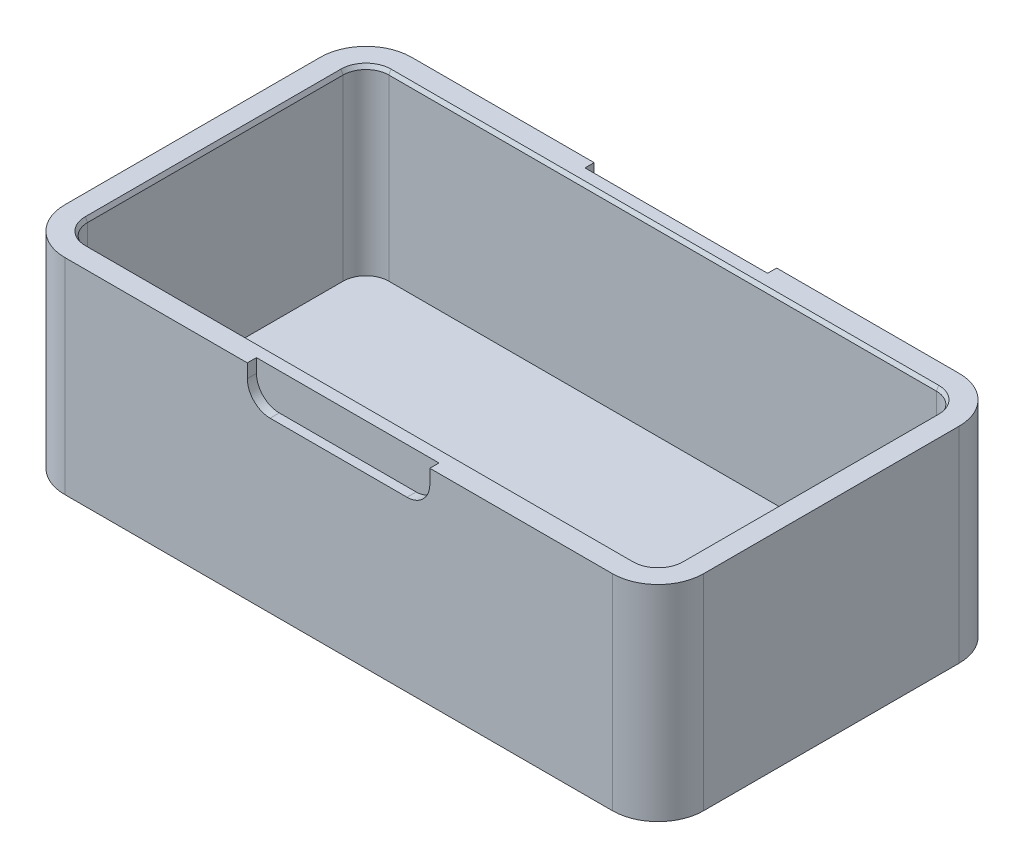
ISO-10303-21;
HEADER;
FILE_DESCRIPTION(('STEP AP214'),'2;1');
FILE_NAME('part.step','',(''),(''),'','','');
FILE_SCHEMA(('AUTOMOTIVE_DESIGN { 1 0 10303 214 1 1 1 1 }'));
ENDSEC;
DATA;
#1=APPLICATION_CONTEXT('core data for automotive mechanical design processes');
#2=APPLICATION_PROTOCOL_DEFINITION('international standard','automotive_design',2000,#1);
#3=PRODUCT_CONTEXT('',#1,'mechanical');
#4=PRODUCT('Part','Part','',(#3));
#5=PRODUCT_RELATED_PRODUCT_CATEGORY('part','',(#4));
#6=PRODUCT_DEFINITION_FORMATION('','',#4);
#7=PRODUCT_DEFINITION_CONTEXT('part definition',#1,'design');
#8=PRODUCT_DEFINITION('design','',#6,#7);
#9=PRODUCT_DEFINITION_SHAPE('','',#8);
#10=(LENGTH_UNIT() NAMED_UNIT(*) SI_UNIT(.MILLI.,.METRE.));
#11=(NAMED_UNIT(*) PLANE_ANGLE_UNIT() SI_UNIT($,.RADIAN.));
#12=(NAMED_UNIT(*) SI_UNIT($,.STERADIAN.) SOLID_ANGLE_UNIT());
#13=UNCERTAINTY_MEASURE_WITH_UNIT(LENGTH_MEASURE(1.E-05),#10,'distance_accuracy_value','');
#14=(GEOMETRIC_REPRESENTATION_CONTEXT(3) GLOBAL_UNCERTAINTY_ASSIGNED_CONTEXT((#13)) GLOBAL_UNIT_ASSIGNED_CONTEXT((#10,
#11,#12)) REPRESENTATION_CONTEXT('',''));
#15=CARTESIAN_POINT('',(0.,0.,0.));
#16=DIRECTION('',(0.,0.,1.));
#17=DIRECTION('',(1.,0.,0.));
#18=AXIS2_PLACEMENT_3D('',#15,#16,#17);
#19=CARTESIAN_POINT('',(0.,45.,-76.));
#20=DIRECTION('',(0.,0.,1.));
#21=DIRECTION('',(1.,0.,0.));
#22=AXIS2_PLACEMENT_3D('',#19,#20,#21);
#23=PLANE('',#22);
#24=DIRECTION('',(0.,-1.,0.));
#25=VECTOR('',#24,1.);
#26=CARTESIAN_POINT('',(50.,45.,-76.));
#27=LINE('',#26,#25);
#28=CARTESIAN_POINT('',(50.,45.,-76.));
#29=VERTEX_POINT('',#28);
#30=CARTESIAN_POINT('',(50.,42.,-76.));
#31=VERTEX_POINT('',#30);
#32=EDGE_CURVE('E493',#29,#31,#27,.T.);
#33=ORIENTED_EDGE('',*,*,#32,.T.);
#34=CARTESIAN_POINT('',(55.,42.,-76.));
#35=DIRECTION('',(0.,0.,1.));
#36=DIRECTION('',(1.,0.,0.));
#37=AXIS2_PLACEMENT_3D('',#34,#35,#36);
#38=CIRCLE('',#37,5.);
#39=CARTESIAN_POINT('',(55.,37.,-76.));
#40=VERTEX_POINT('',#39);
#41=EDGE_CURVE('E440',#31,#40,#38,.T.);
#42=ORIENTED_EDGE('',*,*,#41,.T.);
#43=DIRECTION('',(1.,0.,0.));
#44=VECTOR('',#43,1.);
#45=CARTESIAN_POINT('',(50.,37.,-76.));
#46=LINE('',#45,#44);
#47=CARTESIAN_POINT('',(85.,37.,-76.));
#48=VERTEX_POINT('',#47);
#49=EDGE_CURVE('E277',#40,#48,#46,.T.);
#50=ORIENTED_EDGE('',*,*,#49,.T.);
#51=CARTESIAN_POINT('',(85.,42.,-76.));
#52=DIRECTION('',(0.,0.,1.));
#53=DIRECTION('',(1.,0.,0.));
#54=AXIS2_PLACEMENT_3D('',#51,#52,#53);
#55=CIRCLE('',#54,5.);
#56=CARTESIAN_POINT('',(90.,42.,-76.));
#57=VERTEX_POINT('',#56);
#58=EDGE_CURVE('E438',#48,#57,#55,.T.);
#59=ORIENTED_EDGE('',*,*,#58,.T.);
#60=DIRECTION('',(0.,1.,0.));
#61=VECTOR('',#60,1.);
#62=CARTESIAN_POINT('',(90.,45.,-76.));
#63=LINE('',#62,#61);
#64=CARTESIAN_POINT('',(90.,45.,-76.));
#65=VERTEX_POINT('',#64);
#66=EDGE_CURVE('E499',#57,#65,#63,.T.);
#67=ORIENTED_EDGE('',*,*,#66,.T.);
#68=DIRECTION('',(-1.,0.,0.));
#69=VECTOR('',#68,1.);
#70=CARTESIAN_POINT('',(0.,45.,-76.));
#71=LINE('',#70,#69);
#72=CARTESIAN_POINT('',(130.,45.,-76.));
#73=VERTEX_POINT('',#72);
#74=EDGE_CURVE('E268',#73,#65,#71,.T.);
#75=ORIENTED_EDGE('',*,*,#74,.F.);
#76=DIRECTION('',(0.,-1.,0.));
#77=VECTOR('',#76,1.);
#78=CARTESIAN_POINT('',(130.,45.,-76.));
#79=LINE('',#78,#77);
#80=CARTESIAN_POINT('',(130.,0.,-76.));
#81=VERTEX_POINT('',#80);
#82=EDGE_CURVE('E372',#73,#81,#79,.T.);
#83=ORIENTED_EDGE('',*,*,#82,.T.);
#84=DIRECTION('',(-1.,0.,0.));
#85=VECTOR('',#84,1.);
#86=CARTESIAN_POINT('',(0.,0.,-76.));
#87=LINE('',#86,#85);
#88=CARTESIAN_POINT('',(9.99999999999997,0.,-76.));
#89=VERTEX_POINT('',#88);
#90=EDGE_CURVE('E350',#81,#89,#87,.T.);
#91=ORIENTED_EDGE('',*,*,#90,.T.);
#92=DIRECTION('',(0.,-1.,0.));
#93=VECTOR('',#92,1.);
#94=CARTESIAN_POINT('',(9.99999999999997,45.,-76.));
#95=LINE('',#94,#93);
#96=CARTESIAN_POINT('',(9.99999999999997,45.,-76.));
#97=VERTEX_POINT('',#96);
#98=EDGE_CURVE('E359',#89,#97,#95,.F.);
#99=ORIENTED_EDGE('',*,*,#98,.T.);
#100=EDGE_CURVE('E357',#29,#97,#71,.T.);
#101=ORIENTED_EDGE('',*,*,#100,.F.);
#102=EDGE_LOOP('',(#33,#42,#50,#59,#67,#75,#83,#91,#99,#101));
#103=FACE_BOUND('',#102,.T.);
#104=ADVANCED_FACE('F34',(#103),#23,.F.);
#105=CARTESIAN_POINT('',(0.,45.,0.));
#106=DIRECTION('',(0.,-1.,0.));
#107=DIRECTION('',(0.,0.,-1.));
#108=AXIS2_PLACEMENT_3D('',#105,#106,#107);
#109=PLANE('',#108);
#110=CARTESIAN_POINT('',(130.,45.,-10.));
#111=DIRECTION('',(0.,-1.,0.));
#112=DIRECTION('',(0.,0.,-1.));
#113=AXIS2_PLACEMENT_3D('',#110,#111,#112);
#114=CIRCLE('',#113,5.49999999999999);
#115=CARTESIAN_POINT('',(135.5,45.,-10.));
#116=VERTEX_POINT('',#115);
#117=CARTESIAN_POINT('',(130.,45.,-4.50000000000001));
#118=VERTEX_POINT('',#117);
#119=EDGE_CURVE('E457',#116,#118,#114,.T.);
#120=ORIENTED_EDGE('',*,*,#119,.T.);
#121=DIRECTION('',(-1.,0.,0.));
#122=VECTOR('',#121,1.);
#123=CARTESIAN_POINT('',(0.,45.,-4.50000000000001));
#124=LINE('',#123,#122);
#125=CARTESIAN_POINT('',(9.99999999999999,45.,-4.50000000000001));
#126=VERTEX_POINT('',#125);
#127=EDGE_CURVE('E459',#118,#126,#124,.T.);
#128=ORIENTED_EDGE('',*,*,#127,.T.);
#129=CARTESIAN_POINT('',(9.99999999999999,45.,-10.));
#130=DIRECTION('',(0.,-1.,0.));
#131=DIRECTION('',(0.,0.,-1.));
#132=AXIS2_PLACEMENT_3D('',#129,#130,#131);
#133=CIRCLE('',#132,5.49999999999998);
#134=CARTESIAN_POINT('',(4.50000000000001,45.,-9.99999999999999));
#135=VERTEX_POINT('',#134);
#136=EDGE_CURVE('E455',#126,#135,#133,.T.);
#137=ORIENTED_EDGE('',*,*,#136,.T.);
#138=DIRECTION('',(0.,0.,-1.));
#139=VECTOR('',#138,1.);
#140=CARTESIAN_POINT('',(4.50000000000001,45.,0.));
#141=LINE('',#140,#139);
#142=CARTESIAN_POINT('',(4.49999999999998,45.,-66.));
#143=VERTEX_POINT('',#142);
#144=EDGE_CURVE('E451',#135,#143,#141,.T.);
#145=ORIENTED_EDGE('',*,*,#144,.T.);
#146=CARTESIAN_POINT('',(9.99999999999997,45.,-66.));
#147=DIRECTION('',(0.,-1.,0.));
#148=DIRECTION('',(0.,0.,-1.));
#149=AXIS2_PLACEMENT_3D('',#146,#147,#148);
#150=CIRCLE('',#149,5.49999999999999);
#151=CARTESIAN_POINT('',(9.99999999999998,45.,-71.5));
#152=VERTEX_POINT('',#151);
#153=EDGE_CURVE('E447',#143,#152,#150,.T.);
#154=ORIENTED_EDGE('',*,*,#153,.T.);
#155=DIRECTION('',(1.,0.,0.));
#156=VECTOR('',#155,1.);
#157=CARTESIAN_POINT('',(0.,45.,-71.5));
#158=LINE('',#157,#156);
#159=CARTESIAN_POINT('',(130.,45.,-71.5));
#160=VERTEX_POINT('',#159);
#161=EDGE_CURVE('E445',#152,#160,#158,.T.);
#162=ORIENTED_EDGE('',*,*,#161,.T.);
#163=CARTESIAN_POINT('',(130.,45.,-66.));
#164=DIRECTION('',(0.,-1.,0.));
#165=DIRECTION('',(0.,0.,-1.));
#166=AXIS2_PLACEMENT_3D('',#163,#164,#165);
#167=CIRCLE('',#166,5.50000000000001);
#168=CARTESIAN_POINT('',(135.5,45.,-66.));
#169=VERTEX_POINT('',#168);
#170=EDGE_CURVE('E449',#160,#169,#167,.T.);
#171=ORIENTED_EDGE('',*,*,#170,.T.);
#172=DIRECTION('',(0.,0.,1.));
#173=VECTOR('',#172,1.);
#174=CARTESIAN_POINT('',(135.5,45.,0.));
#175=LINE('',#174,#173);
#176=EDGE_CURVE('E453',#169,#116,#175,.T.);
#177=ORIENTED_EDGE('',*,*,#176,.T.);
#178=EDGE_LOOP('',(#120,#128,#137,#145,#154,#162,#171,#177));
#179=FACE_BOUND('',#178,.T.);
#180=DIRECTION('',(0.,0.,-1.));
#181=VECTOR('',#180,1.);
#182=CARTESIAN_POINT('',(50.,45.,-74.));
#183=LINE('',#182,#181);
#184=CARTESIAN_POINT('',(50.,45.,-74.));
#185=VERTEX_POINT('',#184);
#186=EDGE_CURVE('E270',#185,#29,#183,.T.);
#187=ORIENTED_EDGE('',*,*,#186,.T.);
#188=ORIENTED_EDGE('',*,*,#100,.T.);
#189=CARTESIAN_POINT('',(9.99999999999997,45.,-66.));
#190=DIRECTION('',(0.,-1.,0.));
#191=DIRECTION('',(0.,0.,-1.));
#192=AXIS2_PLACEMENT_3D('',#189,#190,#191);
#193=CIRCLE('',#192,10.);
#194=CARTESIAN_POINT('',(0.,45.,-66.));
#195=VERTEX_POINT('',#194);
#196=EDGE_CURVE('E390',#97,#195,#193,.F.);
#197=ORIENTED_EDGE('',*,*,#196,.T.);
#198=DIRECTION('',(0.,0.,1.));
#199=VECTOR('',#198,1.);
#200=CARTESIAN_POINT('',(0.,45.,0.));
#201=LINE('',#200,#199);
#202=CARTESIAN_POINT('',(0.,45.,-9.99999999999999));
#203=VERTEX_POINT('',#202);
#204=EDGE_CURVE('E346',#195,#203,#201,.T.);
#205=ORIENTED_EDGE('',*,*,#204,.T.);
#206=CARTESIAN_POINT('',(9.99999999999999,45.,-10.));
#207=DIRECTION('',(0.,-1.,0.));
#208=DIRECTION('',(0.,0.,-1.));
#209=AXIS2_PLACEMENT_3D('',#206,#207,#208);
#210=CIRCLE('',#209,10.);
#211=CARTESIAN_POINT('',(9.99999999999999,45.,0.));
#212=VERTEX_POINT('',#211);
#213=EDGE_CURVE('E388',#203,#212,#210,.F.);
#214=ORIENTED_EDGE('',*,*,#213,.T.);
#215=DIRECTION('',(1.,0.,0.));
#216=VECTOR('',#215,1.);
#217=CARTESIAN_POINT('',(0.,45.,0.));
#218=LINE('',#217,#216);
#219=CARTESIAN_POINT('',(50.,45.,0.));
#220=VERTEX_POINT('',#219);
#221=EDGE_CURVE('E351',#212,#220,#218,.T.);
#222=ORIENTED_EDGE('',*,*,#221,.T.);
#223=DIRECTION('',(0.,0.,1.));
#224=VECTOR('',#223,1.);
#225=CARTESIAN_POINT('',(50.,45.,-2.));
#226=LINE('',#225,#224);
#227=CARTESIAN_POINT('',(50.,45.,-2.));
#228=VERTEX_POINT('',#227);
#229=EDGE_CURVE('E296',#228,#220,#226,.T.);
#230=ORIENTED_EDGE('',*,*,#229,.F.);
#231=DIRECTION('',(-1.,0.,0.));
#232=VECTOR('',#231,1.);
#233=CARTESIAN_POINT('',(50.,45.,-2.));
#234=LINE('',#233,#232);
#235=CARTESIAN_POINT('',(90.,45.,-2.));
#236=VERTEX_POINT('',#235);
#237=EDGE_CURVE('E289',#236,#228,#234,.T.);
#238=ORIENTED_EDGE('',*,*,#237,.F.);
#239=DIRECTION('',(0.,0.,1.));
#240=VECTOR('',#239,1.);
#241=CARTESIAN_POINT('',(90.,45.,-2.));
#242=LINE('',#241,#240);
#243=CARTESIAN_POINT('',(90.,45.,0.));
#244=VERTEX_POINT('',#243);
#245=EDGE_CURVE('E291',#236,#244,#242,.T.);
#246=ORIENTED_EDGE('',*,*,#245,.T.);
#247=CARTESIAN_POINT('',(130.,45.,0.));
#248=VERTEX_POINT('',#247);
#249=EDGE_CURVE('E349',#244,#248,#218,.T.);
#250=ORIENTED_EDGE('',*,*,#249,.T.);
#251=CARTESIAN_POINT('',(130.,45.,-10.));
#252=DIRECTION('',(0.,-1.,0.));
#253=DIRECTION('',(0.,0.,-1.));
#254=AXIS2_PLACEMENT_3D('',#251,#252,#253);
#255=CIRCLE('',#254,10.);
#256=CARTESIAN_POINT('',(140.,45.,-10.));
#257=VERTEX_POINT('',#256);
#258=EDGE_CURVE('E392',#248,#257,#255,.F.);
#259=ORIENTED_EDGE('',*,*,#258,.T.);
#260=DIRECTION('',(0.,0.,-1.));
#261=VECTOR('',#260,1.);
#262=CARTESIAN_POINT('',(140.,45.,0.));
#263=LINE('',#262,#261);
#264=CARTESIAN_POINT('',(140.,45.,-66.));
#265=VERTEX_POINT('',#264);
#266=EDGE_CURVE('E354',#257,#265,#263,.T.);
#267=ORIENTED_EDGE('',*,*,#266,.T.);
#268=CARTESIAN_POINT('',(130.,45.,-66.));
#269=DIRECTION('',(0.,-1.,0.));
#270=DIRECTION('',(0.,0.,-1.));
#271=AXIS2_PLACEMENT_3D('',#268,#269,#270);
#272=CIRCLE('',#271,10.);
#273=EDGE_CURVE('E394',#265,#73,#272,.F.);
#274=ORIENTED_EDGE('',*,*,#273,.T.);
#275=ORIENTED_EDGE('',*,*,#74,.T.);
#276=DIRECTION('',(0.,0.,-1.));
#277=VECTOR('',#276,1.);
#278=CARTESIAN_POINT('',(90.,45.,-74.));
#279=LINE('',#278,#277);
#280=CARTESIAN_POINT('',(90.,45.,-74.));
#281=VERTEX_POINT('',#280);
#282=EDGE_CURVE('E249',#281,#65,#279,.T.);
#283=ORIENTED_EDGE('',*,*,#282,.F.);
#284=DIRECTION('',(-1.,0.,0.));
#285=VECTOR('',#284,1.);
#286=CARTESIAN_POINT('',(50.,45.,-74.));
#287=LINE('',#286,#285);
#288=EDGE_CURVE('E256',#281,#185,#287,.T.);
#289=ORIENTED_EDGE('',*,*,#288,.T.);
#290=EDGE_LOOP('',(#187,#188,#197,#205,#214,#222,#230,#238,#246,#250,#259,#267,#274,#275,#283,#289));
#291=FACE_BOUND('',#290,.T.);
#292=ADVANCED_FACE('F266',(#179,#291),#109,.F.);
#293=CARTESIAN_POINT('',(0.,45.,0.));
#294=DIRECTION('',(1.,0.,0.));
#295=DIRECTION('',(0.,0.,-1.));
#296=AXIS2_PLACEMENT_3D('',#293,#294,#295);
#297=PLANE('',#296);
#298=ORIENTED_EDGE('',*,*,#204,.F.);
#299=DIRECTION('',(0.,-1.,0.));
#300=VECTOR('',#299,1.);
#301=CARTESIAN_POINT('',(0.,45.,-66.));
#302=LINE('',#301,#300);
#303=CARTESIAN_POINT('',(0.,0.,-66.));
#304=VERTEX_POINT('',#303);
#305=EDGE_CURVE('E404',#195,#304,#302,.T.);
#306=ORIENTED_EDGE('',*,*,#305,.T.);
#307=DIRECTION('',(0.,0.,1.));
#308=VECTOR('',#307,1.);
#309=CARTESIAN_POINT('',(0.,0.,0.));
#310=LINE('',#309,#308);
#311=CARTESIAN_POINT('',(0.,0.,-9.99999999999999));
#312=VERTEX_POINT('',#311);
#313=EDGE_CURVE('E328',#304,#312,#310,.T.);
#314=ORIENTED_EDGE('',*,*,#313,.T.);
#315=DIRECTION('',(0.,-1.,0.));
#316=VECTOR('',#315,1.);
#317=CARTESIAN_POINT('',(0.,45.,-9.99999999999999));
#318=LINE('',#317,#316);
#319=EDGE_CURVE('E402',#312,#203,#318,.F.);
#320=ORIENTED_EDGE('',*,*,#319,.T.);
#321=EDGE_LOOP('',(#298,#306,#314,#320));
#322=FACE_BOUND('',#321,.T.);
#323=ADVANCED_FACE('F534',(#322),#297,.F.);
#324=CARTESIAN_POINT('',(0.,45.,0.));
#325=DIRECTION('',(0.,0.,-1.));
#326=DIRECTION('',(-1.,0.,0.));
#327=AXIS2_PLACEMENT_3D('',#324,#325,#326);
#328=PLANE('',#327);
#329=DIRECTION('',(1.,0.,0.));
#330=VECTOR('',#329,1.);
#331=CARTESIAN_POINT('',(50.,37.,0.));
#332=LINE('',#331,#330);
#333=CARTESIAN_POINT('',(55.,37.,0.));
#334=VERTEX_POINT('',#333);
#335=CARTESIAN_POINT('',(85.,37.,0.));
#336=VERTEX_POINT('',#335);
#337=EDGE_CURVE('E273',#334,#336,#332,.T.);
#338=ORIENTED_EDGE('',*,*,#337,.F.);
#339=CARTESIAN_POINT('',(55.,42.,0.));
#340=DIRECTION('',(0.,0.,-1.));
#341=DIRECTION('',(-1.,0.,0.));
#342=AXIS2_PLACEMENT_3D('',#339,#340,#341);
#343=CIRCLE('',#342,5.);
#344=CARTESIAN_POINT('',(50.,42.,0.));
#345=VERTEX_POINT('',#344);
#346=EDGE_CURVE('E423',#334,#345,#343,.T.);
#347=ORIENTED_EDGE('',*,*,#346,.T.);
#348=DIRECTION('',(0.,-1.,0.));
#349=VECTOR('',#348,1.);
#350=CARTESIAN_POINT('',(50.,45.,0.));
#351=LINE('',#350,#349);
#352=EDGE_CURVE('E269',#220,#345,#351,.T.);
#353=ORIENTED_EDGE('',*,*,#352,.F.);
#354=ORIENTED_EDGE('',*,*,#221,.F.);
#355=DIRECTION('',(0.,-1.,0.));
#356=VECTOR('',#355,1.);
#357=CARTESIAN_POINT('',(9.99999999999999,45.,0.));
#358=LINE('',#357,#356);
#359=CARTESIAN_POINT('',(9.99999999999999,0.,0.));
#360=VERTEX_POINT('',#359);
#361=EDGE_CURVE('E396',#212,#360,#358,.T.);
#362=ORIENTED_EDGE('',*,*,#361,.T.);
#363=DIRECTION('',(1.,0.,0.));
#364=VECTOR('',#363,1.);
#365=CARTESIAN_POINT('',(0.,0.,0.));
#366=LINE('',#365,#364);
#367=CARTESIAN_POINT('',(130.,0.,0.));
#368=VERTEX_POINT('',#367);
#369=EDGE_CURVE('E362',#360,#368,#366,.T.);
#370=ORIENTED_EDGE('',*,*,#369,.T.);
#371=DIRECTION('',(0.,-1.,0.));
#372=VECTOR('',#371,1.);
#373=CARTESIAN_POINT('',(130.,45.,0.));
#374=LINE('',#373,#372);
#375=EDGE_CURVE('E399',#368,#248,#374,.F.);
#376=ORIENTED_EDGE('',*,*,#375,.T.);
#377=ORIENTED_EDGE('',*,*,#249,.F.);
#378=DIRECTION('',(0.,1.,0.));
#379=VECTOR('',#378,1.);
#380=CARTESIAN_POINT('',(90.,45.,0.));
#381=LINE('',#380,#379);
#382=CARTESIAN_POINT('',(90.,42.,0.));
#383=VERTEX_POINT('',#382);
#384=EDGE_CURVE('E284',#383,#244,#381,.T.);
#385=ORIENTED_EDGE('',*,*,#384,.F.);
#386=CARTESIAN_POINT('',(85.,42.,0.));
#387=DIRECTION('',(0.,0.,-1.));
#388=DIRECTION('',(-1.,0.,0.));
#389=AXIS2_PLACEMENT_3D('',#386,#387,#388);
#390=CIRCLE('',#389,5.);
#391=EDGE_CURVE('E421',#383,#336,#390,.T.);
#392=ORIENTED_EDGE('',*,*,#391,.T.);
#393=EDGE_LOOP('',(#338,#347,#353,#354,#362,#370,#376,#377,#385,#392));
#394=FACE_BOUND('',#393,.T.);
#395=ADVANCED_FACE('F543',(#394),#328,.F.);
#396=CARTESIAN_POINT('',(140.,45.,0.));
#397=DIRECTION('',(-1.,0.,0.));
#398=DIRECTION('',(0.,0.,1.));
#399=AXIS2_PLACEMENT_3D('',#396,#397,#398);
#400=PLANE('',#399);
#401=DIRECTION('',(0.,0.,-1.));
#402=VECTOR('',#401,1.);
#403=CARTESIAN_POINT('',(140.,0.,0.));
#404=LINE('',#403,#402);
#405=CARTESIAN_POINT('',(140.,0.,-10.));
#406=VERTEX_POINT('',#405);
#407=CARTESIAN_POINT('',(140.,0.,-66.));
#408=VERTEX_POINT('',#407);
#409=EDGE_CURVE('E365',#406,#408,#404,.T.);
#410=ORIENTED_EDGE('',*,*,#409,.T.);
#411=DIRECTION('',(0.,-1.,0.));
#412=VECTOR('',#411,1.);
#413=CARTESIAN_POINT('',(140.,45.,-66.));
#414=LINE('',#413,#412);
#415=EDGE_CURVE('E386',#408,#265,#414,.F.);
#416=ORIENTED_EDGE('',*,*,#415,.T.);
#417=ORIENTED_EDGE('',*,*,#266,.F.);
#418=DIRECTION('',(0.,-1.,0.));
#419=VECTOR('',#418,1.);
#420=CARTESIAN_POINT('',(140.,45.,-10.));
#421=LINE('',#420,#419);
#422=EDGE_CURVE('E383',#257,#406,#421,.T.);
#423=ORIENTED_EDGE('',*,*,#422,.T.);
#424=EDGE_LOOP('',(#410,#416,#417,#423));
#425=FACE_BOUND('',#424,.T.);
#426=ADVANCED_FACE('F540',(#425),#400,.F.);
#427=CARTESIAN_POINT('',(0.,0.,0.));
#428=DIRECTION('',(0.,-1.,0.));
#429=DIRECTION('',(0.,0.,-1.));
#430=AXIS2_PLACEMENT_3D('',#427,#428,#429);
#431=PLANE('',#430);
#432=ORIENTED_EDGE('',*,*,#90,.F.);
#433=CARTESIAN_POINT('',(130.,0.,-66.));
#434=DIRECTION('',(0.,-1.,0.));
#435=DIRECTION('',(0.,0.,-1.));
#436=AXIS2_PLACEMENT_3D('',#433,#434,#435);
#437=CIRCLE('',#436,10.);
#438=EDGE_CURVE('E381',#81,#408,#437,.T.);
#439=ORIENTED_EDGE('',*,*,#438,.T.);
#440=ORIENTED_EDGE('',*,*,#409,.F.);
#441=CARTESIAN_POINT('',(130.,0.,-10.));
#442=DIRECTION('',(0.,-1.,0.));
#443=DIRECTION('',(0.,0.,-1.));
#444=AXIS2_PLACEMENT_3D('',#441,#442,#443);
#445=CIRCLE('',#444,10.);
#446=EDGE_CURVE('E379',#406,#368,#445,.T.);
#447=ORIENTED_EDGE('',*,*,#446,.T.);
#448=ORIENTED_EDGE('',*,*,#369,.F.);
#449=CARTESIAN_POINT('',(9.99999999999999,0.,-10.));
#450=DIRECTION('',(0.,-1.,0.));
#451=DIRECTION('',(0.,0.,-1.));
#452=AXIS2_PLACEMENT_3D('',#449,#450,#451);
#453=CIRCLE('',#452,10.);
#454=EDGE_CURVE('E375',#360,#312,#453,.T.);
#455=ORIENTED_EDGE('',*,*,#454,.T.);
#456=ORIENTED_EDGE('',*,*,#313,.F.);
#457=CARTESIAN_POINT('',(9.99999999999997,0.,-66.));
#458=DIRECTION('',(0.,-1.,0.));
#459=DIRECTION('',(0.,0.,-1.));
#460=AXIS2_PLACEMENT_3D('',#457,#458,#459);
#461=CIRCLE('',#460,10.);
#462=EDGE_CURVE('E377',#304,#89,#461,.T.);
#463=ORIENTED_EDGE('',*,*,#462,.T.);
#464=EDGE_LOOP('',(#432,#439,#440,#447,#448,#455,#456,#463));
#465=FACE_BOUND('',#464,.T.);
#466=ADVANCED_FACE('F539',(#465),#431,.T.);
#467=CARTESIAN_POINT('',(130.,45.,-66.));
#468=DIRECTION('',(0.,-1.,0.));
#469=DIRECTION('',(0.,0.,-1.));
#470=AXIS2_PLACEMENT_3D('',#467,#468,#469);
#471=CYLINDRICAL_SURFACE('',#470,10.);
#472=ORIENTED_EDGE('',*,*,#273,.F.);
#473=ORIENTED_EDGE('',*,*,#415,.F.);
#474=ORIENTED_EDGE('',*,*,#438,.F.);
#475=ORIENTED_EDGE('',*,*,#82,.F.);
#476=EDGE_LOOP('',(#472,#473,#474,#475));
#477=FACE_BOUND('',#476,.T.);
#478=ADVANCED_FACE('F551',(#477),#471,.T.);
#479=CARTESIAN_POINT('',(130.,45.,-10.));
#480=DIRECTION('',(0.,-1.,0.));
#481=DIRECTION('',(0.,0.,-1.));
#482=AXIS2_PLACEMENT_3D('',#479,#480,#481);
#483=CYLINDRICAL_SURFACE('',#482,10.);
#484=ORIENTED_EDGE('',*,*,#258,.F.);
#485=ORIENTED_EDGE('',*,*,#375,.F.);
#486=ORIENTED_EDGE('',*,*,#446,.F.);
#487=ORIENTED_EDGE('',*,*,#422,.F.);
#488=EDGE_LOOP('',(#484,#485,#486,#487));
#489=FACE_BOUND('',#488,.T.);
#490=ADVANCED_FACE('F554',(#489),#483,.T.);
#491=CARTESIAN_POINT('',(9.99999999999997,45.,-66.));
#492=DIRECTION('',(0.,-1.,0.));
#493=DIRECTION('',(0.,0.,-1.));
#494=AXIS2_PLACEMENT_3D('',#491,#492,#493);
#495=CYLINDRICAL_SURFACE('',#494,10.);
#496=ORIENTED_EDGE('',*,*,#196,.F.);
#497=ORIENTED_EDGE('',*,*,#98,.F.);
#498=ORIENTED_EDGE('',*,*,#462,.F.);
#499=ORIENTED_EDGE('',*,*,#305,.F.);
#500=EDGE_LOOP('',(#496,#497,#498,#499));
#501=FACE_BOUND('',#500,.T.);
#502=ADVANCED_FACE('F558',(#501),#495,.T.);
#503=CARTESIAN_POINT('',(9.99999999999999,45.,-10.));
#504=DIRECTION('',(0.,-1.,0.));
#505=DIRECTION('',(0.,0.,-1.));
#506=AXIS2_PLACEMENT_3D('',#503,#504,#505);
#507=CYLINDRICAL_SURFACE('',#506,10.);
#508=ORIENTED_EDGE('',*,*,#213,.F.);
#509=ORIENTED_EDGE('',*,*,#319,.F.);
#510=ORIENTED_EDGE('',*,*,#454,.F.);
#511=ORIENTED_EDGE('',*,*,#361,.F.);
#512=EDGE_LOOP('',(#508,#509,#510,#511));
#513=FACE_BOUND('',#512,.T.);
#514=ADVANCED_FACE('F562',(#513),#507,.T.);
#515=CARTESIAN_POINT('',(130.,5.,-10.));
#516=DIRECTION('',(0.,1.,0.));
#517=DIRECTION('',(0.,0.,1.));
#518=AXIS2_PLACEMENT_3D('',#515,#516,#517);
#519=CYLINDRICAL_SURFACE('',#518,5.);
#520=DIRECTION('',(0.,1.,0.));
#521=VECTOR('',#520,1.);
#522=CARTESIAN_POINT('',(130.,5.,-5.));
#523=LINE('',#522,#521);
#524=CARTESIAN_POINT('',(130.,5.,-5.));
#525=VERTEX_POINT('',#524);
#526=CARTESIAN_POINT('',(130.,44.1339745962156,-5.));
#527=VERTEX_POINT('',#526);
#528=EDGE_CURVE('E325',#525,#527,#523,.T.);
#529=ORIENTED_EDGE('',*,*,#528,.T.);
#530=CARTESIAN_POINT('',(130.,44.1339745962156,-10.));
#531=DIRECTION('',(0.,-1.,0.));
#532=DIRECTION('',(0.,0.,-1.));
#533=AXIS2_PLACEMENT_3D('',#530,#531,#532);
#534=CIRCLE('',#533,5.);
#535=CARTESIAN_POINT('',(135.,44.1339745962156,-10.));
#536=VERTEX_POINT('',#535);
#537=EDGE_CURVE('E462',#527,#536,#534,.F.);
#538=ORIENTED_EDGE('',*,*,#537,.T.);
#539=DIRECTION('',(0.,1.,0.));
#540=VECTOR('',#539,1.);
#541=CARTESIAN_POINT('',(135.,5.,-10.));
#542=LINE('',#541,#540);
#543=CARTESIAN_POINT('',(135.,5.,-10.));
#544=VERTEX_POINT('',#543);
#545=EDGE_CURVE('E324',#544,#536,#542,.T.);
#546=ORIENTED_EDGE('',*,*,#545,.F.);
#547=CARTESIAN_POINT('',(130.,5.,-10.));
#548=DIRECTION('',(0.,1.,0.));
#549=DIRECTION('',(0.,0.,1.));
#550=AXIS2_PLACEMENT_3D('',#547,#548,#549);
#551=CIRCLE('',#550,5.);
#552=EDGE_CURVE('E298',#525,#544,#551,.T.);
#553=ORIENTED_EDGE('',*,*,#552,.F.);
#554=EDGE_LOOP('',(#529,#538,#546,#553));
#555=FACE_BOUND('',#554,.T.);
#556=ADVANCED_FACE('F566',(#555),#519,.F.);
#557=CARTESIAN_POINT('',(9.99999999999999,5.,-5.));
#558=DIRECTION('',(0.,0.,1.));
#559=DIRECTION('',(1.,0.,0.));
#560=AXIS2_PLACEMENT_3D('',#557,#558,#559);
#561=PLANE('',#560);
#562=DIRECTION('',(0.,1.,0.));
#563=VECTOR('',#562,1.);
#564=CARTESIAN_POINT('',(9.99999999999999,5.,-5.));
#565=LINE('',#564,#563);
#566=CARTESIAN_POINT('',(9.99999999999999,5.,-5.));
#567=VERTEX_POINT('',#566);
#568=CARTESIAN_POINT('',(9.99999999999999,44.1339745962156,-5.));
#569=VERTEX_POINT('',#568);
#570=EDGE_CURVE('E329',#567,#569,#565,.T.);
#571=ORIENTED_EDGE('',*,*,#570,.T.);
#572=DIRECTION('',(1.,0.,0.));
#573=VECTOR('',#572,1.);
#574=CARTESIAN_POINT('',(9.99999999999999,44.1339745962156,-5.));
#575=LINE('',#574,#573);
#576=EDGE_CURVE('E442',#569,#527,#575,.T.);
#577=ORIENTED_EDGE('',*,*,#576,.T.);
#578=ORIENTED_EDGE('',*,*,#528,.F.);
#579=DIRECTION('',(1.,0.,0.));
#580=VECTOR('',#579,1.);
#581=CARTESIAN_POINT('',(9.99999999999999,5.,-5.));
#582=LINE('',#581,#580);
#583=EDGE_CURVE('E321',#567,#525,#582,.T.);
#584=ORIENTED_EDGE('',*,*,#583,.F.);
#585=EDGE_LOOP('',(#571,#577,#578,#584));
#586=FACE_BOUND('',#585,.T.);
#587=ADVANCED_FACE('F650',(#586),#561,.F.);
#588=CARTESIAN_POINT('',(9.99999999999999,5.,-10.));
#589=DIRECTION('',(0.,1.,0.));
#590=DIRECTION('',(0.,0.,1.));
#591=AXIS2_PLACEMENT_3D('',#588,#589,#590);
#592=CYLINDRICAL_SURFACE('',#591,5.);
#593=DIRECTION('',(0.,1.,0.));
#594=VECTOR('',#593,1.);
#595=CARTESIAN_POINT('',(5.,5.,-9.99999999999999));
#596=LINE('',#595,#594);
#597=CARTESIAN_POINT('',(5.,5.,-9.99999999999999));
#598=VERTEX_POINT('',#597);
#599=CARTESIAN_POINT('',(5.,44.1339745962156,-9.99999999999999));
#600=VERTEX_POINT('',#599);
#601=EDGE_CURVE('E332',#598,#600,#596,.T.);
#602=ORIENTED_EDGE('',*,*,#601,.T.);
#603=CARTESIAN_POINT('',(9.99999999999999,44.1339745962156,-10.));
#604=DIRECTION('',(0.,-1.,0.));
#605=DIRECTION('',(0.,0.,-1.));
#606=AXIS2_PLACEMENT_3D('',#603,#604,#605);
#607=CIRCLE('',#606,5.);
#608=EDGE_CURVE('E464',#600,#569,#607,.F.);
#609=ORIENTED_EDGE('',*,*,#608,.T.);
#610=ORIENTED_EDGE('',*,*,#570,.F.);
#611=CARTESIAN_POINT('',(9.99999999999999,5.,-10.));
#612=DIRECTION('',(0.,1.,0.));
#613=DIRECTION('',(0.,0.,1.));
#614=AXIS2_PLACEMENT_3D('',#611,#612,#613);
#615=CIRCLE('',#614,5.);
#616=EDGE_CURVE('E318',#598,#567,#615,.T.);
#617=ORIENTED_EDGE('',*,*,#616,.F.);
#618=EDGE_LOOP('',(#602,#609,#610,#617));
#619=FACE_BOUND('',#618,.T.);
#620=ADVANCED_FACE('F659',(#619),#592,.F.);
#621=CARTESIAN_POINT('',(4.99999999999997,5.,-66.));
#622=DIRECTION('',(-1.,0.,0.));
#623=DIRECTION('',(0.,0.,1.));
#624=AXIS2_PLACEMENT_3D('',#621,#622,#623);
#625=PLANE('',#624);
#626=DIRECTION('',(0.,1.,0.));
#627=VECTOR('',#626,1.);
#628=CARTESIAN_POINT('',(4.99999999999997,5.,-66.));
#629=LINE('',#628,#627);
#630=CARTESIAN_POINT('',(4.99999999999997,5.,-66.));
#631=VERTEX_POINT('',#630);
#632=CARTESIAN_POINT('',(4.99999999999997,44.1339745962156,-66.));
#633=VERTEX_POINT('',#632);
#634=EDGE_CURVE('E335',#631,#633,#629,.T.);
#635=ORIENTED_EDGE('',*,*,#634,.T.);
#636=DIRECTION('',(0.,0.,1.));
#637=VECTOR('',#636,1.);
#638=CARTESIAN_POINT('',(4.99999999999997,44.1339745962156,-66.));
#639=LINE('',#638,#637);
#640=EDGE_CURVE('E468',#633,#600,#639,.T.);
#641=ORIENTED_EDGE('',*,*,#640,.T.);
#642=ORIENTED_EDGE('',*,*,#601,.F.);
#643=DIRECTION('',(0.,0.,1.));
#644=VECTOR('',#643,1.);
#645=CARTESIAN_POINT('',(4.99999999999997,5.,-66.));
#646=LINE('',#645,#644);
#647=EDGE_CURVE('E315',#631,#598,#646,.T.);
#648=ORIENTED_EDGE('',*,*,#647,.F.);
#649=EDGE_LOOP('',(#635,#641,#642,#648));
#650=FACE_BOUND('',#649,.T.);
#651=ADVANCED_FACE('F667',(#650),#625,.F.);
#652=CARTESIAN_POINT('',(9.99999999999997,5.,-66.));
#653=DIRECTION('',(0.,1.,0.));
#654=DIRECTION('',(0.,0.,1.));
#655=AXIS2_PLACEMENT_3D('',#652,#653,#654);
#656=CYLINDRICAL_SURFACE('',#655,5.);
#657=DIRECTION('',(0.,1.,0.));
#658=VECTOR('',#657,1.);
#659=CARTESIAN_POINT('',(9.99999999999998,5.,-71.));
#660=LINE('',#659,#658);
#661=CARTESIAN_POINT('',(9.99999999999998,5.,-71.));
#662=VERTEX_POINT('',#661);
#663=CARTESIAN_POINT('',(9.99999999999998,44.1339745962156,-71.));
#664=VERTEX_POINT('',#663);
#665=EDGE_CURVE('E338',#662,#664,#660,.T.);
#666=ORIENTED_EDGE('',*,*,#665,.T.);
#667=CARTESIAN_POINT('',(9.99999999999997,44.1339745962156,-66.));
#668=DIRECTION('',(0.,-1.,0.));
#669=DIRECTION('',(0.,0.,-1.));
#670=AXIS2_PLACEMENT_3D('',#667,#668,#669);
#671=CIRCLE('',#670,5.);
#672=EDGE_CURVE('E43',#664,#633,#671,.F.);
#673=ORIENTED_EDGE('',*,*,#672,.T.);
#674=ORIENTED_EDGE('',*,*,#634,.F.);
#675=CARTESIAN_POINT('',(9.99999999999997,5.,-66.));
#676=DIRECTION('',(0.,1.,0.));
#677=DIRECTION('',(0.,0.,1.));
#678=AXIS2_PLACEMENT_3D('',#675,#676,#677);
#679=CIRCLE('',#678,5.);
#680=EDGE_CURVE('E312',#662,#631,#679,.T.);
#681=ORIENTED_EDGE('',*,*,#680,.F.);
#682=EDGE_LOOP('',(#666,#673,#674,#681));
#683=FACE_BOUND('',#682,.T.);
#684=ADVANCED_FACE('F675',(#683),#656,.F.);
#685=CARTESIAN_POINT('',(130.,5.,-71.));
#686=DIRECTION('',(0.,0.,-1.));
#687=DIRECTION('',(-1.,0.,0.));
#688=AXIS2_PLACEMENT_3D('',#685,#686,#687);
#689=PLANE('',#688);
#690=DIRECTION('',(0.,1.,0.));
#691=VECTOR('',#690,1.);
#692=CARTESIAN_POINT('',(130.,5.,-71.));
#693=LINE('',#692,#691);
#694=CARTESIAN_POINT('',(130.,5.,-71.));
#695=VERTEX_POINT('',#694);
#696=CARTESIAN_POINT('',(130.,44.1339745962156,-71.));
#697=VERTEX_POINT('',#696);
#698=EDGE_CURVE('E340',#695,#697,#693,.T.);
#699=ORIENTED_EDGE('',*,*,#698,.T.);
#700=DIRECTION('',(-1.,0.,0.));
#701=VECTOR('',#700,1.);
#702=CARTESIAN_POINT('',(130.,44.1339745962156,-71.));
#703=LINE('',#702,#701);
#704=EDGE_CURVE('E11',#697,#664,#703,.T.);
#705=ORIENTED_EDGE('',*,*,#704,.T.);
#706=ORIENTED_EDGE('',*,*,#665,.F.);
#707=DIRECTION('',(-1.,0.,0.));
#708=VECTOR('',#707,1.);
#709=CARTESIAN_POINT('',(130.,5.,-71.));
#710=LINE('',#709,#708);
#711=EDGE_CURVE('E309',#695,#662,#710,.T.);
#712=ORIENTED_EDGE('',*,*,#711,.F.);
#713=EDGE_LOOP('',(#699,#705,#706,#712));
#714=FACE_BOUND('',#713,.T.);
#715=ADVANCED_FACE('F683',(#714),#689,.F.);
#716=CARTESIAN_POINT('',(130.,5.,-66.));
#717=DIRECTION('',(0.,1.,0.));
#718=DIRECTION('',(0.,0.,1.));
#719=AXIS2_PLACEMENT_3D('',#716,#717,#718);
#720=CYLINDRICAL_SURFACE('',#719,5.00000000000002);
#721=DIRECTION('',(0.,1.,0.));
#722=VECTOR('',#721,1.);
#723=CARTESIAN_POINT('',(135.,5.,-66.));
#724=LINE('',#723,#722);
#725=CARTESIAN_POINT('',(135.,5.,-66.));
#726=VERTEX_POINT('',#725);
#727=CARTESIAN_POINT('',(135.,44.1339745962156,-66.));
#728=VERTEX_POINT('',#727);
#729=EDGE_CURVE('E342',#726,#728,#724,.T.);
#730=ORIENTED_EDGE('',*,*,#729,.T.);
#731=CARTESIAN_POINT('',(130.,44.1339745962156,-66.));
#732=DIRECTION('',(0.,-1.,0.));
#733=DIRECTION('',(0.,0.,-1.));
#734=AXIS2_PLACEMENT_3D('',#731,#732,#733);
#735=CIRCLE('',#734,5.00000000000002);
#736=EDGE_CURVE('E57',#728,#697,#735,.F.);
#737=ORIENTED_EDGE('',*,*,#736,.T.);
#738=ORIENTED_EDGE('',*,*,#698,.F.);
#739=CARTESIAN_POINT('',(130.,5.,-66.));
#740=DIRECTION('',(0.,1.,0.));
#741=DIRECTION('',(0.,0.,1.));
#742=AXIS2_PLACEMENT_3D('',#739,#740,#741);
#743=CIRCLE('',#742,5.00000000000002);
#744=EDGE_CURVE('E306',#726,#695,#743,.T.);
#745=ORIENTED_EDGE('',*,*,#744,.F.);
#746=EDGE_LOOP('',(#730,#737,#738,#745));
#747=FACE_BOUND('',#746,.T.);
#748=ADVANCED_FACE('F691',(#747),#720,.F.);
#749=CARTESIAN_POINT('',(135.,5.,-10.));
#750=DIRECTION('',(1.,0.,0.));
#751=DIRECTION('',(0.,0.,-1.));
#752=AXIS2_PLACEMENT_3D('',#749,#750,#751);
#753=PLANE('',#752);
#754=ORIENTED_EDGE('',*,*,#545,.T.);
#755=DIRECTION('',(0.,0.,-1.));
#756=VECTOR('',#755,1.);
#757=CARTESIAN_POINT('',(135.,44.1339745962156,-10.));
#758=LINE('',#757,#756);
#759=EDGE_CURVE('E466',#536,#728,#758,.T.);
#760=ORIENTED_EDGE('',*,*,#759,.T.);
#761=ORIENTED_EDGE('',*,*,#729,.F.);
#762=DIRECTION('',(0.,0.,-1.));
#763=VECTOR('',#762,1.);
#764=CARTESIAN_POINT('',(135.,5.,-10.));
#765=LINE('',#764,#763);
#766=EDGE_CURVE('E303',#544,#726,#765,.T.);
#767=ORIENTED_EDGE('',*,*,#766,.F.);
#768=EDGE_LOOP('',(#754,#760,#761,#767));
#769=FACE_BOUND('',#768,.T.);
#770=ADVANCED_FACE('F698',(#769),#753,.F.);
#771=CARTESIAN_POINT('',(130.,5.,-10.));
#772=DIRECTION('',(0.,1.,0.));
#773=DIRECTION('',(0.,0.,1.));
#774=AXIS2_PLACEMENT_3D('',#771,#772,#773);
#775=PLANE('',#774);
#776=ORIENTED_EDGE('',*,*,#552,.T.);
#777=ORIENTED_EDGE('',*,*,#766,.T.);
#778=ORIENTED_EDGE('',*,*,#744,.T.);
#779=ORIENTED_EDGE('',*,*,#711,.T.);
#780=ORIENTED_EDGE('',*,*,#680,.T.);
#781=ORIENTED_EDGE('',*,*,#647,.T.);
#782=ORIENTED_EDGE('',*,*,#616,.T.);
#783=ORIENTED_EDGE('',*,*,#583,.T.);
#784=EDGE_LOOP('',(#776,#777,#778,#779,#780,#781,#782,#783));
#785=FACE_BOUND('',#784,.T.);
#786=ADVANCED_FACE('F705',(#785),#775,.T.);
#787=CARTESIAN_POINT('',(50.,45.,-2.));
#788=DIRECTION('',(-1.,0.,0.));
#789=DIRECTION('',(0.,-1.,0.));
#790=AXIS2_PLACEMENT_3D('',#787,#788,#789);
#791=PLANE('',#790);
#792=ORIENTED_EDGE('',*,*,#352,.T.);
#793=DIRECTION('',(0.,0.,1.));
#794=VECTOR('',#793,1.);
#795=CARTESIAN_POINT('',(50.,42.,-2.));
#796=LINE('',#795,#794);
#797=CARTESIAN_POINT('',(50.,42.,-2.));
#798=VERTEX_POINT('',#797);
#799=EDGE_CURVE('E419',#345,#798,#796,.F.);
#800=ORIENTED_EDGE('',*,*,#799,.T.);
#801=DIRECTION('',(0.,-1.,0.));
#802=VECTOR('',#801,1.);
#803=CARTESIAN_POINT('',(50.,45.,-2.));
#804=LINE('',#803,#802);
#805=EDGE_CURVE('E280',#228,#798,#804,.T.);
#806=ORIENTED_EDGE('',*,*,#805,.F.);
#807=ORIENTED_EDGE('',*,*,#229,.T.);
#808=EDGE_LOOP('',(#792,#800,#806,#807));
#809=FACE_BOUND('',#808,.T.);
#810=ADVANCED_FACE('F602',(#809),#791,.F.);
#811=CARTESIAN_POINT('',(90.,45.,-2.));
#812=DIRECTION('',(1.,0.,0.));
#813=DIRECTION('',(0.,0.,-1.));
#814=AXIS2_PLACEMENT_3D('',#811,#812,#813);
#815=PLANE('',#814);
#816=DIRECTION('',(0.,1.,0.));
#817=VECTOR('',#816,1.);
#818=CARTESIAN_POINT('',(90.,45.,-2.));
#819=LINE('',#818,#817);
#820=CARTESIAN_POINT('',(90.,42.,-2.));
#821=VERTEX_POINT('',#820);
#822=EDGE_CURVE('E287',#821,#236,#819,.T.);
#823=ORIENTED_EDGE('',*,*,#822,.F.);
#824=DIRECTION('',(0.,0.,1.));
#825=VECTOR('',#824,1.);
#826=CARTESIAN_POINT('',(90.,42.,0.));
#827=LINE('',#826,#825);
#828=EDGE_CURVE('E407',#821,#383,#827,.T.);
#829=ORIENTED_EDGE('',*,*,#828,.T.);
#830=ORIENTED_EDGE('',*,*,#384,.T.);
#831=ORIENTED_EDGE('',*,*,#245,.F.);
#832=EDGE_LOOP('',(#823,#829,#830,#831));
#833=FACE_BOUND('',#832,.T.);
#834=ADVANCED_FACE('F594',(#833),#815,.F.);
#835=CARTESIAN_POINT('',(50.,37.,-2.));
#836=DIRECTION('',(0.,-1.,0.));
#837=DIRECTION('',(0.,0.,-1.));
#838=AXIS2_PLACEMENT_3D('',#835,#836,#837);
#839=PLANE('',#838);
#840=ORIENTED_EDGE('',*,*,#337,.T.);
#841=DIRECTION('',(0.,0.,1.));
#842=VECTOR('',#841,1.);
#843=CARTESIAN_POINT('',(85.,37.,-2.));
#844=LINE('',#843,#842);
#845=CARTESIAN_POINT('',(85.,37.,-2.));
#846=VERTEX_POINT('',#845);
#847=EDGE_CURVE('E413',#336,#846,#844,.F.);
#848=ORIENTED_EDGE('',*,*,#847,.T.);
#849=DIRECTION('',(1.,0.,0.));
#850=VECTOR('',#849,1.);
#851=CARTESIAN_POINT('',(50.,37.,-2.));
#852=LINE('',#851,#850);
#853=CARTESIAN_POINT('',(55.,37.,-2.));
#854=VERTEX_POINT('',#853);
#855=EDGE_CURVE('E283',#854,#846,#852,.T.);
#856=ORIENTED_EDGE('',*,*,#855,.F.);
#857=DIRECTION('',(0.,0.,1.));
#858=VECTOR('',#857,1.);
#859=CARTESIAN_POINT('',(55.,37.,0.));
#860=LINE('',#859,#858);
#861=EDGE_CURVE('E410',#854,#334,#860,.T.);
#862=ORIENTED_EDGE('',*,*,#861,.T.);
#863=EDGE_LOOP('',(#840,#848,#856,#862));
#864=FACE_BOUND('',#863,.T.);
#865=ADVANCED_FACE('F587',(#864),#839,.F.);
#866=CARTESIAN_POINT('',(0.,0.,-2.));
#867=DIRECTION('',(0.,0.,1.));
#868=DIRECTION('',(1.,0.,0.));
#869=AXIS2_PLACEMENT_3D('',#866,#867,#868);
#870=PLANE('',#869);
#871=ORIENTED_EDGE('',*,*,#855,.T.);
#872=CARTESIAN_POINT('',(85.,42.,-2.));
#873=DIRECTION('',(0.,0.,1.));
#874=DIRECTION('',(1.,0.,0.));
#875=AXIS2_PLACEMENT_3D('',#872,#873,#874);
#876=CIRCLE('',#875,5.);
#877=EDGE_CURVE('E417',#846,#821,#876,.T.);
#878=ORIENTED_EDGE('',*,*,#877,.T.);
#879=ORIENTED_EDGE('',*,*,#822,.T.);
#880=ORIENTED_EDGE('',*,*,#237,.T.);
#881=ORIENTED_EDGE('',*,*,#805,.T.);
#882=CARTESIAN_POINT('',(55.,42.,-2.));
#883=DIRECTION('',(0.,0.,1.));
#884=DIRECTION('',(1.,0.,0.));
#885=AXIS2_PLACEMENT_3D('',#882,#883,#884);
#886=CIRCLE('',#885,5.);
#887=EDGE_CURVE('E415',#798,#854,#886,.T.);
#888=ORIENTED_EDGE('',*,*,#887,.T.);
#889=EDGE_LOOP('',(#871,#878,#879,#880,#881,#888));
#890=FACE_BOUND('',#889,.T.);
#891=ADVANCED_FACE('F571',(#890),#870,.T.);
#892=CARTESIAN_POINT('',(85.,42.,-2.));
#893=DIRECTION('',(0.,0.,-1.));
#894=DIRECTION('',(-1.,0.,0.));
#895=AXIS2_PLACEMENT_3D('',#892,#893,#894);
#896=CYLINDRICAL_SURFACE('',#895,5.);
#897=ORIENTED_EDGE('',*,*,#877,.F.);
#898=ORIENTED_EDGE('',*,*,#847,.F.);
#899=ORIENTED_EDGE('',*,*,#391,.F.);
#900=ORIENTED_EDGE('',*,*,#828,.F.);
#901=EDGE_LOOP('',(#897,#898,#899,#900));
#902=FACE_BOUND('',#901,.T.);
#903=ADVANCED_FACE('F568',(#902),#896,.F.);
#904=CARTESIAN_POINT('',(55.,42.,-2.));
#905=DIRECTION('',(0.,0.,-1.));
#906=DIRECTION('',(-1.,0.,0.));
#907=AXIS2_PLACEMENT_3D('',#904,#905,#906);
#908=CYLINDRICAL_SURFACE('',#907,5.);
#909=ORIENTED_EDGE('',*,*,#887,.F.);
#910=ORIENTED_EDGE('',*,*,#799,.F.);
#911=ORIENTED_EDGE('',*,*,#346,.F.);
#912=ORIENTED_EDGE('',*,*,#861,.F.);
#913=EDGE_LOOP('',(#909,#910,#911,#912));
#914=FACE_BOUND('',#913,.T.);
#915=ADVANCED_FACE('F570',(#914),#908,.F.);
#916=CARTESIAN_POINT('',(50.,45.,-74.));
#917=DIRECTION('',(1.,0.,0.));
#918=DIRECTION('',(0.,1.,0.));
#919=AXIS2_PLACEMENT_3D('',#916,#917,#918);
#920=PLANE('',#919);
#921=DIRECTION('',(0.,-1.,0.));
#922=VECTOR('',#921,1.);
#923=CARTESIAN_POINT('',(50.,45.,-74.));
#924=LINE('',#923,#922);
#925=CARTESIAN_POINT('',(50.,42.,-74.));
#926=VERTEX_POINT('',#925);
#927=EDGE_CURVE('E261',#185,#926,#924,.T.);
#928=ORIENTED_EDGE('',*,*,#927,.T.);
#929=DIRECTION('',(0.,0.,-1.));
#930=VECTOR('',#929,1.);
#931=CARTESIAN_POINT('',(50.,42.,-76.));
#932=LINE('',#931,#930);
#933=EDGE_CURVE('E435',#926,#31,#932,.T.);
#934=ORIENTED_EDGE('',*,*,#933,.T.);
#935=ORIENTED_EDGE('',*,*,#32,.F.);
#936=ORIENTED_EDGE('',*,*,#186,.F.);
#937=EDGE_LOOP('',(#928,#934,#935,#936));
#938=FACE_BOUND('',#937,.T.);
#939=ADVANCED_FACE('F574',(#938),#920,.T.);
#940=CARTESIAN_POINT('',(50.,37.,-74.));
#941=DIRECTION('',(0.,1.,0.));
#942=DIRECTION('',(0.,0.,1.));
#943=AXIS2_PLACEMENT_3D('',#940,#941,#942);
#944=PLANE('',#943);
#945=DIRECTION('',(1.,0.,0.));
#946=VECTOR('',#945,1.);
#947=CARTESIAN_POINT('',(50.,37.,-74.));
#948=LINE('',#947,#946);
#949=CARTESIAN_POINT('',(55.,37.,-74.));
#950=VERTEX_POINT('',#949);
#951=CARTESIAN_POINT('',(85.,37.,-74.));
#952=VERTEX_POINT('',#951);
#953=EDGE_CURVE('E255',#950,#952,#948,.T.);
#954=ORIENTED_EDGE('',*,*,#953,.T.);
#955=DIRECTION('',(0.,0.,-1.));
#956=VECTOR('',#955,1.);
#957=CARTESIAN_POINT('',(85.,37.,-76.));
#958=LINE('',#957,#956);
#959=EDGE_CURVE('E427',#952,#48,#958,.T.);
#960=ORIENTED_EDGE('',*,*,#959,.T.);
#961=ORIENTED_EDGE('',*,*,#49,.F.);
#962=DIRECTION('',(0.,0.,-1.));
#963=VECTOR('',#962,1.);
#964=CARTESIAN_POINT('',(55.,37.,-74.));
#965=LINE('',#964,#963);
#966=EDGE_CURVE('E425',#40,#950,#965,.F.);
#967=ORIENTED_EDGE('',*,*,#966,.T.);
#968=EDGE_LOOP('',(#954,#960,#961,#967));
#969=FACE_BOUND('',#968,.T.);
#970=ADVANCED_FACE('F512',(#969),#944,.T.);
#971=CARTESIAN_POINT('',(90.,45.,-74.));
#972=DIRECTION('',(-1.,0.,0.));
#973=DIRECTION('',(0.,0.,1.));
#974=AXIS2_PLACEMENT_3D('',#971,#972,#973);
#975=PLANE('',#974);
#976=ORIENTED_EDGE('',*,*,#66,.F.);
#977=DIRECTION('',(0.,0.,-1.));
#978=VECTOR('',#977,1.);
#979=CARTESIAN_POINT('',(90.,42.,-74.));
#980=LINE('',#979,#978);
#981=CARTESIAN_POINT('',(90.,42.,-74.));
#982=VERTEX_POINT('',#981);
#983=EDGE_CURVE('E252',#57,#982,#980,.F.);
#984=ORIENTED_EDGE('',*,*,#983,.T.);
#985=DIRECTION('',(0.,1.,0.));
#986=VECTOR('',#985,1.);
#987=CARTESIAN_POINT('',(90.,45.,-74.));
#988=LINE('',#987,#986);
#989=EDGE_CURVE('E244',#982,#281,#988,.T.);
#990=ORIENTED_EDGE('',*,*,#989,.T.);
#991=ORIENTED_EDGE('',*,*,#282,.T.);
#992=EDGE_LOOP('',(#976,#984,#990,#991));
#993=FACE_BOUND('',#992,.T.);
#994=ADVANCED_FACE('F247',(#993),#975,.T.);
#995=CARTESIAN_POINT('',(0.,0.,-74.));
#996=DIRECTION('',(0.,0.,-1.));
#997=DIRECTION('',(1.,0.,0.));
#998=AXIS2_PLACEMENT_3D('',#995,#996,#997);
#999=PLANE('',#998);
#1000=ORIENTED_EDGE('',*,*,#989,.F.);
#1001=CARTESIAN_POINT('',(85.,42.,-74.));
#1002=DIRECTION('',(0.,0.,-1.));
#1003=DIRECTION('',(-1.,0.,0.));
#1004=AXIS2_PLACEMENT_3D('',#1001,#1002,#1003);
#1005=CIRCLE('',#1004,5.);
#1006=EDGE_CURVE('E433',#982,#952,#1005,.T.);
#1007=ORIENTED_EDGE('',*,*,#1006,.T.);
#1008=ORIENTED_EDGE('',*,*,#953,.F.);
#1009=CARTESIAN_POINT('',(55.,42.,-74.));
#1010=DIRECTION('',(0.,0.,-1.));
#1011=DIRECTION('',(-1.,0.,0.));
#1012=AXIS2_PLACEMENT_3D('',#1009,#1010,#1011);
#1013=CIRCLE('',#1012,5.);
#1014=EDGE_CURVE('E431',#950,#926,#1013,.T.);
#1015=ORIENTED_EDGE('',*,*,#1014,.T.);
#1016=ORIENTED_EDGE('',*,*,#927,.F.);
#1017=ORIENTED_EDGE('',*,*,#288,.F.);
#1018=EDGE_LOOP('',(#1000,#1007,#1008,#1015,#1016,#1017));
#1019=FACE_BOUND('',#1018,.T.);
#1020=ADVANCED_FACE('F259',(#1019),#999,.T.);
#1021=CARTESIAN_POINT('',(85.,42.,-74.));
#1022=DIRECTION('',(0.,0.,1.));
#1023=DIRECTION('',(1.,0.,0.));
#1024=AXIS2_PLACEMENT_3D('',#1021,#1022,#1023);
#1025=CYLINDRICAL_SURFACE('',#1024,5.);
#1026=ORIENTED_EDGE('',*,*,#1006,.F.);
#1027=ORIENTED_EDGE('',*,*,#983,.F.);
#1028=ORIENTED_EDGE('',*,*,#58,.F.);
#1029=ORIENTED_EDGE('',*,*,#959,.F.);
#1030=EDGE_LOOP('',(#1026,#1027,#1028,#1029));
#1031=FACE_BOUND('',#1030,.T.);
#1032=ADVANCED_FACE('F519',(#1031),#1025,.F.);
#1033=CARTESIAN_POINT('',(55.,42.,-74.));
#1034=DIRECTION('',(0.,0.,1.));
#1035=DIRECTION('',(1.,0.,0.));
#1036=AXIS2_PLACEMENT_3D('',#1033,#1034,#1035);
#1037=CYLINDRICAL_SURFACE('',#1036,5.);
#1038=ORIENTED_EDGE('',*,*,#1014,.F.);
#1039=ORIENTED_EDGE('',*,*,#966,.F.);
#1040=ORIENTED_EDGE('',*,*,#41,.F.);
#1041=ORIENTED_EDGE('',*,*,#933,.F.);
#1042=EDGE_LOOP('',(#1038,#1039,#1040,#1041));
#1043=FACE_BOUND('',#1042,.T.);
#1044=ADVANCED_FACE('F517',(#1043),#1037,.F.);
#1045=CARTESIAN_POINT('',(130.,44.1339745962156,-71.));
#1046=DIRECTION('',(0.,-0.500000000000002,-0.866025403784438));
#1047=DIRECTION('',(-1.,0.,0.));
#1048=AXIS2_PLACEMENT_3D('',#1045,#1046,#1047);
#1049=PLANE('',#1048);
#1050=DIRECTION('',(0.,-0.866025403784438,0.5));
#1051=VECTOR('',#1050,1.);
#1052=CARTESIAN_POINT('',(130.,45.,-71.5));
#1053=LINE('',#1052,#1051);
#1054=EDGE_CURVE('E487',#160,#697,#1053,.T.);
#1055=ORIENTED_EDGE('',*,*,#1054,.F.);
#1056=ORIENTED_EDGE('',*,*,#161,.F.);
#1057=DIRECTION('',(0.,0.866025403784438,-0.5));
#1058=VECTOR('',#1057,1.);
#1059=CARTESIAN_POINT('',(9.99999999999998,44.1339745962156,-71.));
#1060=LINE('',#1059,#1058);
#1061=EDGE_CURVE('E38',#664,#152,#1060,.T.);
#1062=ORIENTED_EDGE('',*,*,#1061,.F.);
#1063=ORIENTED_EDGE('',*,*,#704,.F.);
#1064=EDGE_LOOP('',(#1055,#1056,#1062,#1063));
#1065=FACE_BOUND('',#1064,.T.);
#1066=ADVANCED_FACE('F36',(#1065),#1049,.F.);
#1067=CARTESIAN_POINT('',(9.99999999999997,44.1339745962156,-66.));
#1068=DIRECTION('',(0.,1.,0.));
#1069=DIRECTION('',(0.,0.,1.));
#1070=AXIS2_PLACEMENT_3D('',#1067,#1068,#1069);
#1071=CONICAL_SURFACE('',#1070,5.,0.523598775598299);
#1072=ORIENTED_EDGE('',*,*,#1061,.T.);
#1073=ORIENTED_EDGE('',*,*,#153,.F.);
#1074=DIRECTION('',(-0.5,0.866025403784438,0.));
#1075=VECTOR('',#1074,1.);
#1076=CARTESIAN_POINT('',(4.99999999999997,44.1339745962156,-66.));
#1077=LINE('',#1076,#1075);
#1078=EDGE_CURVE('E485',#633,#143,#1077,.T.);
#1079=ORIENTED_EDGE('',*,*,#1078,.F.);
#1080=ORIENTED_EDGE('',*,*,#672,.F.);
#1081=EDGE_LOOP('',(#1072,#1073,#1079,#1080));
#1082=FACE_BOUND('',#1081,.T.);
#1083=ADVANCED_FACE('F853',(#1082),#1071,.F.);
#1084=CARTESIAN_POINT('',(130.,44.1339745962156,-66.));
#1085=DIRECTION('',(0.,1.,0.));
#1086=DIRECTION('',(0.,0.,1.));
#1087=AXIS2_PLACEMENT_3D('',#1084,#1085,#1086);
#1088=CONICAL_SURFACE('',#1087,5.00000000000002,0.523598775598293);
#1089=ORIENTED_EDGE('',*,*,#1054,.T.);
#1090=ORIENTED_EDGE('',*,*,#736,.F.);
#1091=DIRECTION('',(-0.49999999999999,-0.866025403784444,0.));
#1092=VECTOR('',#1091,1.);
#1093=CARTESIAN_POINT('',(135.5,45.,-66.));
#1094=LINE('',#1093,#1092);
#1095=EDGE_CURVE('E482',#169,#728,#1094,.T.);
#1096=ORIENTED_EDGE('',*,*,#1095,.F.);
#1097=ORIENTED_EDGE('',*,*,#170,.F.);
#1098=EDGE_LOOP('',(#1089,#1090,#1096,#1097));
#1099=FACE_BOUND('',#1098,.T.);
#1100=ADVANCED_FACE('F859',(#1099),#1088,.F.);
#1101=CARTESIAN_POINT('',(4.99999999999997,44.1339745962156,-66.));
#1102=DIRECTION('',(-0.866025403784438,-0.5,0.));
#1103=DIRECTION('',(0.,0.,1.));
#1104=AXIS2_PLACEMENT_3D('',#1101,#1102,#1103);
#1105=PLANE('',#1104);
#1106=ORIENTED_EDGE('',*,*,#1078,.T.);
#1107=ORIENTED_EDGE('',*,*,#144,.F.);
#1108=DIRECTION('',(-0.5,0.866025403784438,0.));
#1109=VECTOR('',#1108,1.);
#1110=CARTESIAN_POINT('',(5.,44.1339745962156,-9.99999999999999));
#1111=LINE('',#1110,#1109);
#1112=EDGE_CURVE('E479',#600,#135,#1111,.T.);
#1113=ORIENTED_EDGE('',*,*,#1112,.F.);
#1114=ORIENTED_EDGE('',*,*,#640,.F.);
#1115=EDGE_LOOP('',(#1106,#1107,#1113,#1114));
#1116=FACE_BOUND('',#1115,.T.);
#1117=ADVANCED_FACE('F865',(#1116),#1105,.F.);
#1118=CARTESIAN_POINT('',(135.,44.1339745962156,-10.));
#1119=DIRECTION('',(0.866025403784435,-0.500000000000007,0.));
#1120=DIRECTION('',(0.,0.,-1.));
#1121=AXIS2_PLACEMENT_3D('',#1118,#1119,#1120);
#1122=PLANE('',#1121);
#1123=ORIENTED_EDGE('',*,*,#1095,.T.);
#1124=ORIENTED_EDGE('',*,*,#759,.F.);
#1125=DIRECTION('',(-0.500000000000011,-0.866025403784432,0.));
#1126=VECTOR('',#1125,1.);
#1127=CARTESIAN_POINT('',(135.5,45.,-10.));
#1128=LINE('',#1127,#1126);
#1129=EDGE_CURVE('E476',#116,#536,#1128,.T.);
#1130=ORIENTED_EDGE('',*,*,#1129,.F.);
#1131=ORIENTED_EDGE('',*,*,#176,.F.);
#1132=EDGE_LOOP('',(#1123,#1124,#1130,#1131));
#1133=FACE_BOUND('',#1132,.T.);
#1134=ADVANCED_FACE('F872',(#1133),#1122,.F.);
#1135=CARTESIAN_POINT('',(9.99999999999999,44.1339745962156,-10.));
#1136=DIRECTION('',(0.,1.,0.));
#1137=DIRECTION('',(0.,0.,1.));
#1138=AXIS2_PLACEMENT_3D('',#1135,#1136,#1137);
#1139=CONICAL_SURFACE('',#1138,5.,0.523598775598299);
#1140=ORIENTED_EDGE('',*,*,#1112,.T.);
#1141=ORIENTED_EDGE('',*,*,#136,.F.);
#1142=DIRECTION('',(0.,0.866025403784438,0.5));
#1143=VECTOR('',#1142,1.);
#1144=CARTESIAN_POINT('',(9.99999999999999,44.1339745962156,-5.));
#1145=LINE('',#1144,#1143);
#1146=EDGE_CURVE('E474',#569,#126,#1145,.T.);
#1147=ORIENTED_EDGE('',*,*,#1146,.F.);
#1148=ORIENTED_EDGE('',*,*,#608,.F.);
#1149=EDGE_LOOP('',(#1140,#1141,#1147,#1148));
#1150=FACE_BOUND('',#1149,.T.);
#1151=ADVANCED_FACE('F880',(#1150),#1139,.F.);
#1152=CARTESIAN_POINT('',(130.,44.1339745962156,-10.));
#1153=DIRECTION('',(0.,1.,0.));
#1154=DIRECTION('',(0.,0.,1.));
#1155=AXIS2_PLACEMENT_3D('',#1152,#1153,#1154);
#1156=CONICAL_SURFACE('',#1155,5.,0.523598775598299);
#1157=ORIENTED_EDGE('',*,*,#1129,.T.);
#1158=ORIENTED_EDGE('',*,*,#537,.F.);
#1159=DIRECTION('',(0.,-0.866025403784438,-0.5));
#1160=VECTOR('',#1159,1.);
#1161=CARTESIAN_POINT('',(130.,45.,-4.50000000000001));
#1162=LINE('',#1161,#1160);
#1163=EDGE_CURVE('E472',#118,#527,#1162,.T.);
#1164=ORIENTED_EDGE('',*,*,#1163,.F.);
#1165=ORIENTED_EDGE('',*,*,#119,.F.);
#1166=EDGE_LOOP('',(#1157,#1158,#1164,#1165));
#1167=FACE_BOUND('',#1166,.T.);
#1168=ADVANCED_FACE('F888',(#1167),#1156,.F.);
#1169=CARTESIAN_POINT('',(9.99999999999999,44.1339745962156,-5.));
#1170=DIRECTION('',(0.,-0.5,0.866025403784438));
#1171=DIRECTION('',(1.,0.,0.));
#1172=AXIS2_PLACEMENT_3D('',#1169,#1170,#1171);
#1173=PLANE('',#1172);
#1174=ORIENTED_EDGE('',*,*,#1146,.T.);
#1175=ORIENTED_EDGE('',*,*,#127,.F.);
#1176=ORIENTED_EDGE('',*,*,#1163,.T.);
#1177=ORIENTED_EDGE('',*,*,#576,.F.);
#1178=EDGE_LOOP('',(#1174,#1175,#1176,#1177));
#1179=FACE_BOUND('',#1178,.T.);
#1180=ADVANCED_FACE('F896',(#1179),#1173,.F.);
#1181=CLOSED_SHELL('',(#104,#292,#323,#395,#426,#466,#478,#490,#502,#514,#556,#587,#620,#651,
#684,#715,#748,#770,#786,#810,#834,#865,#891,#903,#915,#939,#970,#994,#1020,#1032,#1044,#1066,
#1083,#1100,#1117,#1134,#1151,#1168,#1180));
#1182=MANIFOLD_SOLID_BREP('B2',#1181);
#1183=ADVANCED_BREP_SHAPE_REPRESENTATION('',(#18,#1182),#14);
#1184=SHAPE_DEFINITION_REPRESENTATION(#9,#1183);
ENDSEC;
END-ISO-10303-21;
